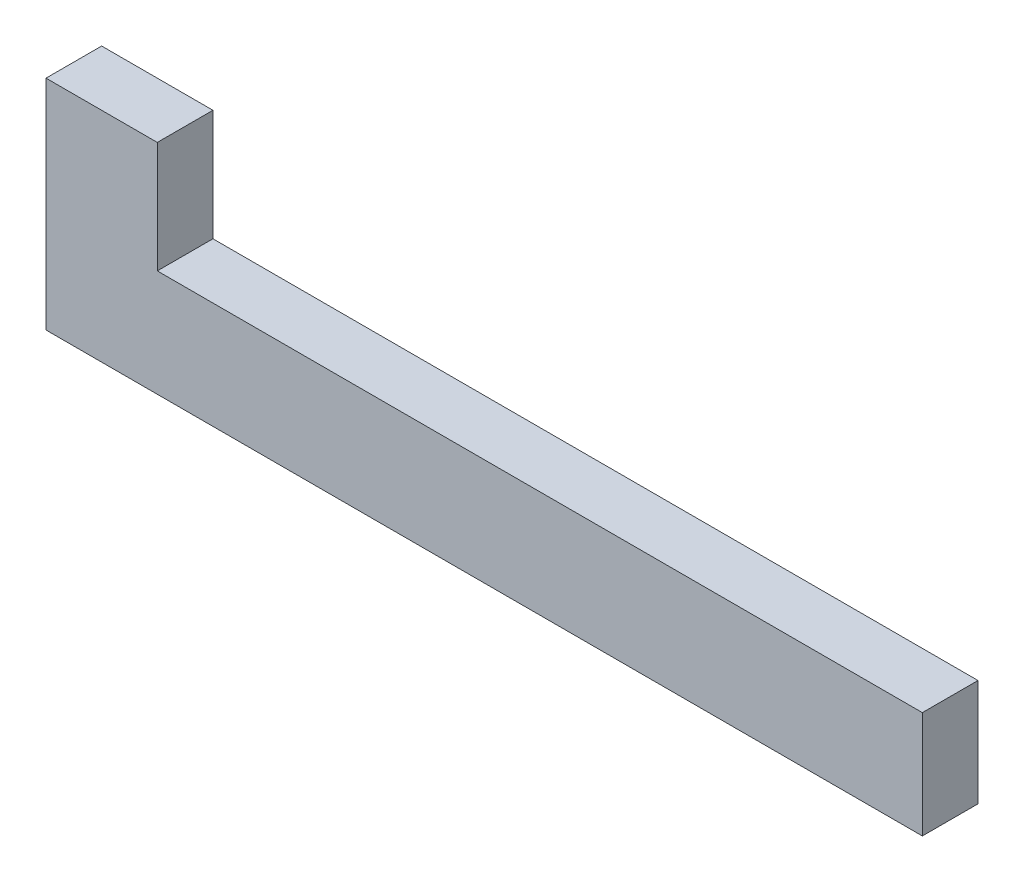
ISO-10303-21;
HEADER;
FILE_DESCRIPTION(('STEP AP214'),'2;1');
FILE_NAME('part.step','',(''),(''),'','','');
FILE_SCHEMA(('AUTOMOTIVE_DESIGN { 1 0 10303 214 1 1 1 1 }'));
ENDSEC;
DATA;
#1=APPLICATION_CONTEXT('core data for automotive mechanical design processes');
#2=APPLICATION_PROTOCOL_DEFINITION('international standard','automotive_design',2000,#1);
#3=PRODUCT_CONTEXT('',#1,'mechanical');
#4=PRODUCT('Part','Part','',(#3));
#5=PRODUCT_RELATED_PRODUCT_CATEGORY('part','',(#4));
#6=PRODUCT_DEFINITION_FORMATION('','',#4);
#7=PRODUCT_DEFINITION_CONTEXT('part definition',#1,'design');
#8=PRODUCT_DEFINITION('design','',#6,#7);
#9=PRODUCT_DEFINITION_SHAPE('','',#8);
#10=(LENGTH_UNIT() NAMED_UNIT(*) SI_UNIT(.MILLI.,.METRE.));
#11=(NAMED_UNIT(*) PLANE_ANGLE_UNIT() SI_UNIT($,.RADIAN.));
#12=(NAMED_UNIT(*) SI_UNIT($,.STERADIAN.) SOLID_ANGLE_UNIT());
#13=UNCERTAINTY_MEASURE_WITH_UNIT(LENGTH_MEASURE(1.E-05),#10,'distance_accuracy_value','');
#14=(GEOMETRIC_REPRESENTATION_CONTEXT(3) GLOBAL_UNCERTAINTY_ASSIGNED_CONTEXT((#13)) GLOBAL_UNIT_ASSIGNED_CONTEXT((#10,
#11,#12)) REPRESENTATION_CONTEXT('',''));
#15=CARTESIAN_POINT('',(0.,0.,0.));
#16=DIRECTION('',(0.,0.,1.));
#17=DIRECTION('',(1.,0.,0.));
#18=AXIS2_PLACEMENT_3D('',#15,#16,#17);
#19=CARTESIAN_POINT('',(25.,6.096,-1.5875));
#20=DIRECTION('',(-1.,0.,0.));
#21=DIRECTION('',(0.,0.,1.));
#22=AXIS2_PLACEMENT_3D('',#19,#20,#21);
#23=PLANE('',#22);
#24=DIRECTION('',(0.,0.,-1.));
#25=VECTOR('',#24,1.);
#26=CARTESIAN_POINT('',(25.,0.,-1.5875));
#27=LINE('',#26,#25);
#28=CARTESIAN_POINT('',(25.,0.,1.5875));
#29=VERTEX_POINT('',#28);
#30=CARTESIAN_POINT('',(25.,0.,-1.5875));
#31=VERTEX_POINT('',#30);
#32=EDGE_CURVE('E92',#29,#31,#27,.T.);
#33=ORIENTED_EDGE('',*,*,#32,.T.);
#34=DIRECTION('',(0.,-1.,0.));
#35=VECTOR('',#34,1.);
#36=CARTESIAN_POINT('',(25.,6.096,-1.5875));
#37=LINE('',#36,#35);
#38=CARTESIAN_POINT('',(25.,6.096,-1.5875));
#39=VERTEX_POINT('',#38);
#40=EDGE_CURVE('E11',#39,#31,#37,.T.);
#41=ORIENTED_EDGE('',*,*,#40,.F.);
#42=DIRECTION('',(0.,0.,-1.));
#43=VECTOR('',#42,1.);
#44=CARTESIAN_POINT('',(25.,6.096,-1.5875));
#45=LINE('',#44,#43);
#46=CARTESIAN_POINT('',(25.,6.096,1.5875));
#47=VERTEX_POINT('',#46);
#48=EDGE_CURVE('E86',#47,#39,#45,.T.);
#49=ORIENTED_EDGE('',*,*,#48,.F.);
#50=DIRECTION('',(0.,-1.,0.));
#51=VECTOR('',#50,1.);
#52=CARTESIAN_POINT('',(25.,6.096,1.5875));
#53=LINE('',#52,#51);
#54=EDGE_CURVE('E78',#47,#29,#53,.T.);
#55=ORIENTED_EDGE('',*,*,#54,.T.);
#56=EDGE_LOOP('',(#33,#41,#49,#55));
#57=FACE_BOUND('',#56,.T.);
#58=ADVANCED_FACE('F36',(#57),#23,.F.);
#59=CARTESIAN_POINT('',(-25.,6.096,-1.5875));
#60=DIRECTION('',(0.,0.,1.));
#61=DIRECTION('',(1.,0.,0.));
#62=AXIS2_PLACEMENT_3D('',#59,#60,#61);
#63=PLANE('',#62);
#64=DIRECTION('',(-1.,0.,0.));
#65=VECTOR('',#64,1.);
#66=CARTESIAN_POINT('',(-25.,0.,-1.5875));
#67=LINE('',#66,#65);
#68=CARTESIAN_POINT('',(-25.,0.,-1.5875));
#69=VERTEX_POINT('',#68);
#70=EDGE_CURVE('E95',#31,#69,#67,.T.);
#71=ORIENTED_EDGE('',*,*,#70,.T.);
#72=DIRECTION('',(0.,-1.,0.));
#73=VECTOR('',#72,1.);
#74=CARTESIAN_POINT('',(-25.,6.096,-1.5875));
#75=LINE('',#74,#73);
#76=CARTESIAN_POINT('',(-25.,12.446,-1.5875));
#77=VERTEX_POINT('',#76);
#78=EDGE_CURVE('E43',#77,#69,#75,.T.);
#79=ORIENTED_EDGE('',*,*,#78,.F.);
#80=DIRECTION('',(1.,0.,0.));
#81=VECTOR('',#80,1.);
#82=CARTESIAN_POINT('',(-25.,12.446,-1.5875));
#83=LINE('',#82,#81);
#84=CARTESIAN_POINT('',(-18.65,12.446,-1.5875));
#85=VERTEX_POINT('',#84);
#86=EDGE_CURVE('E119',#77,#85,#83,.T.);
#87=ORIENTED_EDGE('',*,*,#86,.T.);
#88=DIRECTION('',(0.,-1.,0.));
#89=VECTOR('',#88,1.);
#90=CARTESIAN_POINT('',(-18.65,6.096,-1.5875));
#91=LINE('',#90,#89);
#92=CARTESIAN_POINT('',(-18.65,6.096,-1.5875));
#93=VERTEX_POINT('',#92);
#94=EDGE_CURVE('E134',#85,#93,#91,.T.);
#95=ORIENTED_EDGE('',*,*,#94,.T.);
#96=DIRECTION('',(-1.,0.,0.));
#97=VECTOR('',#96,1.);
#98=CARTESIAN_POINT('',(-25.,6.096,-1.5875));
#99=LINE('',#98,#97);
#100=EDGE_CURVE('E140',#39,#93,#99,.T.);
#101=ORIENTED_EDGE('',*,*,#100,.F.);
#102=ORIENTED_EDGE('',*,*,#40,.T.);
#103=EDGE_LOOP('',(#71,#79,#87,#95,#101,#102));
#104=FACE_BOUND('',#103,.T.);
#105=ADVANCED_FACE('F116',(#104),#63,.F.);
#106=CARTESIAN_POINT('',(-25.,6.096,-1.5875));
#107=DIRECTION('',(1.,0.,0.));
#108=DIRECTION('',(0.,0.,-1.));
#109=AXIS2_PLACEMENT_3D('',#106,#107,#108);
#110=PLANE('',#109);
#111=DIRECTION('',(0.,0.,1.));
#112=VECTOR('',#111,1.);
#113=CARTESIAN_POINT('',(-25.,0.,-1.5875));
#114=LINE('',#113,#112);
#115=CARTESIAN_POINT('',(-25.,0.,1.5875));
#116=VERTEX_POINT('',#115);
#117=EDGE_CURVE('E87',#69,#116,#114,.T.);
#118=ORIENTED_EDGE('',*,*,#117,.T.);
#119=DIRECTION('',(0.,-1.,0.));
#120=VECTOR('',#119,1.);
#121=CARTESIAN_POINT('',(-25.,6.096,1.5875));
#122=LINE('',#121,#120);
#123=CARTESIAN_POINT('',(-25.,12.446,1.5875));
#124=VERTEX_POINT('',#123);
#125=EDGE_CURVE('E82',#124,#116,#122,.T.);
#126=ORIENTED_EDGE('',*,*,#125,.F.);
#127=DIRECTION('',(0.,0.,-1.));
#128=VECTOR('',#127,1.);
#129=CARTESIAN_POINT('',(-25.,12.446,10.5677561210692));
#130=LINE('',#129,#128);
#131=EDGE_CURVE('E112',#124,#77,#130,.T.);
#132=ORIENTED_EDGE('',*,*,#131,.T.);
#133=ORIENTED_EDGE('',*,*,#78,.T.);
#134=EDGE_LOOP('',(#118,#126,#132,#133));
#135=FACE_BOUND('',#134,.T.);
#136=ADVANCED_FACE('F109',(#135),#110,.F.);
#137=CARTESIAN_POINT('',(-25.,6.096,1.5875));
#138=DIRECTION('',(0.,0.,-1.));
#139=DIRECTION('',(-1.,0.,0.));
#140=AXIS2_PLACEMENT_3D('',#137,#138,#139);
#141=PLANE('',#140);
#142=DIRECTION('',(1.,0.,0.));
#143=VECTOR('',#142,1.);
#144=CARTESIAN_POINT('',(-25.,0.,1.5875));
#145=LINE('',#144,#143);
#146=EDGE_CURVE('E75',#116,#29,#145,.T.);
#147=ORIENTED_EDGE('',*,*,#146,.T.);
#148=ORIENTED_EDGE('',*,*,#54,.F.);
#149=DIRECTION('',(1.,0.,0.));
#150=VECTOR('',#149,1.);
#151=CARTESIAN_POINT('',(-25.,6.096,1.5875));
#152=LINE('',#151,#150);
#153=CARTESIAN_POINT('',(-18.65,6.096,1.5875));
#154=VERTEX_POINT('',#153);
#155=EDGE_CURVE('E55',#154,#47,#152,.T.);
#156=ORIENTED_EDGE('',*,*,#155,.F.);
#157=DIRECTION('',(0.,1.,0.));
#158=VECTOR('',#157,1.);
#159=CARTESIAN_POINT('',(-18.65,6.096,1.5875));
#160=LINE('',#159,#158);
#161=CARTESIAN_POINT('',(-18.65,12.446,1.58750000000001));
#162=VERTEX_POINT('',#161);
#163=EDGE_CURVE('E99',#154,#162,#160,.T.);
#164=ORIENTED_EDGE('',*,*,#163,.T.);
#165=DIRECTION('',(-1.,0.,0.));
#166=VECTOR('',#165,1.);
#167=CARTESIAN_POINT('',(-25.,12.446,1.5875));
#168=LINE('',#167,#166);
#169=EDGE_CURVE('E96',#162,#124,#168,.T.);
#170=ORIENTED_EDGE('',*,*,#169,.T.);
#171=ORIENTED_EDGE('',*,*,#125,.T.);
#172=EDGE_LOOP('',(#147,#148,#156,#164,#170,#171));
#173=FACE_BOUND('',#172,.T.);
#174=ADVANCED_FACE('F77',(#173),#141,.F.);
#175=CARTESIAN_POINT('',(0.,6.096,0.));
#176=DIRECTION('',(0.,1.,0.));
#177=DIRECTION('',(0.,0.,1.));
#178=AXIS2_PLACEMENT_3D('',#175,#176,#177);
#179=PLANE('',#178);
#180=DIRECTION('',(0.,0.,-1.));
#181=VECTOR('',#180,1.);
#182=CARTESIAN_POINT('',(-18.65,6.096,10.5677561210692));
#183=LINE('',#182,#181);
#184=EDGE_CURVE('E50',#154,#93,#183,.T.);
#185=ORIENTED_EDGE('',*,*,#184,.F.);
#186=ORIENTED_EDGE('',*,*,#155,.T.);
#187=ORIENTED_EDGE('',*,*,#48,.T.);
#188=ORIENTED_EDGE('',*,*,#100,.T.);
#189=EDGE_LOOP('',(#185,#186,#187,#188));
#190=FACE_BOUND('',#189,.T.);
#191=ADVANCED_FACE('F141',(#190),#179,.T.);
#192=CARTESIAN_POINT('',(0.,0.,0.));
#193=DIRECTION('',(0.,1.,0.));
#194=DIRECTION('',(0.,0.,1.));
#195=AXIS2_PLACEMENT_3D('',#192,#193,#194);
#196=PLANE('',#195);
#197=ORIENTED_EDGE('',*,*,#32,.F.);
#198=ORIENTED_EDGE('',*,*,#146,.F.);
#199=ORIENTED_EDGE('',*,*,#117,.F.);
#200=ORIENTED_EDGE('',*,*,#70,.F.);
#201=EDGE_LOOP('',(#197,#198,#199,#200));
#202=FACE_BOUND('',#201,.T.);
#203=ADVANCED_FACE('F94',(#202),#196,.F.);
#204=CARTESIAN_POINT('',(-18.65,6.096,10.5677561210692));
#205=DIRECTION('',(1.,0.,0.));
#206=DIRECTION('',(0.,0.,-1.));
#207=AXIS2_PLACEMENT_3D('',#204,#205,#206);
#208=PLANE('',#207);
#209=ORIENTED_EDGE('',*,*,#163,.F.);
#210=ORIENTED_EDGE('',*,*,#184,.T.);
#211=ORIENTED_EDGE('',*,*,#94,.F.);
#212=DIRECTION('',(0.,0.,-1.));
#213=VECTOR('',#212,1.);
#214=CARTESIAN_POINT('',(-18.65,12.446,10.5677561210692));
#215=LINE('',#214,#213);
#216=EDGE_CURVE('E133',#162,#85,#215,.T.);
#217=ORIENTED_EDGE('',*,*,#216,.F.);
#218=EDGE_LOOP('',(#209,#210,#211,#217));
#219=FACE_BOUND('',#218,.T.);
#220=ADVANCED_FACE('F144',(#219),#208,.T.);
#221=CARTESIAN_POINT('',(-25.,12.446,10.5677561210692));
#222=DIRECTION('',(0.,1.,0.));
#223=DIRECTION('',(-1.,0.,0.));
#224=AXIS2_PLACEMENT_3D('',#221,#222,#223);
#225=PLANE('',#224);
#226=ORIENTED_EDGE('',*,*,#169,.F.);
#227=ORIENTED_EDGE('',*,*,#216,.T.);
#228=ORIENTED_EDGE('',*,*,#86,.F.);
#229=ORIENTED_EDGE('',*,*,#131,.F.);
#230=EDGE_LOOP('',(#226,#227,#228,#229));
#231=FACE_BOUND('',#230,.T.);
#232=ADVANCED_FACE('F132',(#231),#225,.T.);
#233=CLOSED_SHELL('',(#58,#105,#136,#174,#191,#203,#220,#232));
#234=MANIFOLD_SOLID_BREP('B2',#233);
#235=ADVANCED_BREP_SHAPE_REPRESENTATION('',(#18,#234),#14);
#236=SHAPE_DEFINITION_REPRESENTATION(#9,#235);
ENDSEC;
END-ISO-10303-21;
